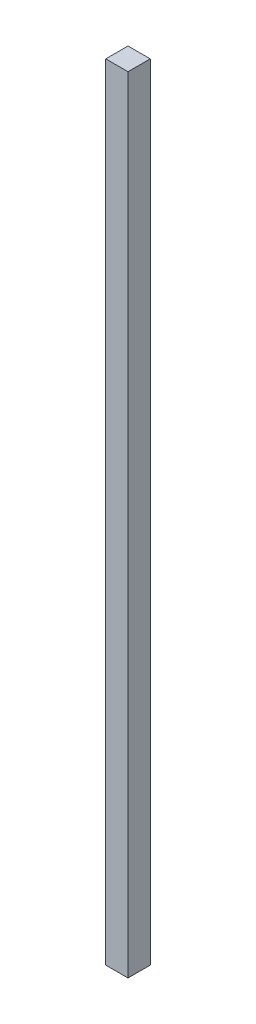
ISO-10303-21;
HEADER;
FILE_DESCRIPTION(('STEP AP214'),'2;1');
FILE_NAME('part.step','',(''),(''),'','','');
FILE_SCHEMA(('AUTOMOTIVE_DESIGN { 1 0 10303 214 1 1 1 1 }'));
ENDSEC;
DATA;
#1=APPLICATION_CONTEXT('core data for automotive mechanical design processes');
#2=APPLICATION_PROTOCOL_DEFINITION('international standard','automotive_design',2000,#1);
#3=PRODUCT_CONTEXT('',#1,'mechanical');
#4=PRODUCT('Part','Part','',(#3));
#5=PRODUCT_RELATED_PRODUCT_CATEGORY('part','',(#4));
#6=PRODUCT_DEFINITION_FORMATION('','',#4);
#7=PRODUCT_DEFINITION_CONTEXT('part definition',#1,'design');
#8=PRODUCT_DEFINITION('design','',#6,#7);
#9=PRODUCT_DEFINITION_SHAPE('','',#8);
#10=(LENGTH_UNIT() NAMED_UNIT(*) SI_UNIT(.MILLI.,.METRE.));
#11=(NAMED_UNIT(*) PLANE_ANGLE_UNIT() SI_UNIT($,.RADIAN.));
#12=(NAMED_UNIT(*) SI_UNIT($,.STERADIAN.) SOLID_ANGLE_UNIT());
#13=UNCERTAINTY_MEASURE_WITH_UNIT(LENGTH_MEASURE(1.E-05),#10,'distance_accuracy_value','');
#14=(GEOMETRIC_REPRESENTATION_CONTEXT(3) GLOBAL_UNCERTAINTY_ASSIGNED_CONTEXT((#13)) GLOBAL_UNIT_ASSIGNED_CONTEXT((#10,
#11,#12)) REPRESENTATION_CONTEXT('',''));
#15=CARTESIAN_POINT('',(0.,0.,0.));
#16=DIRECTION('',(0.,0.,1.));
#17=DIRECTION('',(1.,0.,0.));
#18=AXIS2_PLACEMENT_3D('',#15,#16,#17);
#19=CARTESIAN_POINT('',(2.5,176.37,-2.5));
#20=DIRECTION('',(-1.,0.,0.));
#21=DIRECTION('',(0.,0.,1.));
#22=AXIS2_PLACEMENT_3D('',#19,#20,#21);
#23=PLANE('',#22);
#24=DIRECTION('',(0.,0.,-1.));
#25=VECTOR('',#24,1.);
#26=CARTESIAN_POINT('',(2.5,0.,-2.5));
#27=LINE('',#26,#25);
#28=CARTESIAN_POINT('',(2.5,0.,2.5));
#29=VERTEX_POINT('',#28);
#30=CARTESIAN_POINT('',(2.5,0.,-2.5));
#31=VERTEX_POINT('',#30);
#32=EDGE_CURVE('E98',#29,#31,#27,.T.);
#33=ORIENTED_EDGE('',*,*,#32,.T.);
#34=DIRECTION('',(0.,-1.,0.));
#35=VECTOR('',#34,1.);
#36=CARTESIAN_POINT('',(2.5,176.37,-2.5));
#37=LINE('',#36,#35);
#38=CARTESIAN_POINT('',(2.5,176.37,-2.5));
#39=VERTEX_POINT('',#38);
#40=EDGE_CURVE('E11',#39,#31,#37,.T.);
#41=ORIENTED_EDGE('',*,*,#40,.F.);
#42=DIRECTION('',(0.,0.,-1.));
#43=VECTOR('',#42,1.);
#44=CARTESIAN_POINT('',(2.5,176.37,-2.5));
#45=LINE('',#44,#43);
#46=CARTESIAN_POINT('',(2.5,176.37,2.5));
#47=VERTEX_POINT('',#46);
#48=EDGE_CURVE('E86',#47,#39,#45,.T.);
#49=ORIENTED_EDGE('',*,*,#48,.F.);
#50=DIRECTION('',(0.,-1.,0.));
#51=VECTOR('',#50,1.);
#52=CARTESIAN_POINT('',(2.5,176.37,2.5));
#53=LINE('',#52,#51);
#54=EDGE_CURVE('E94',#47,#29,#53,.T.);
#55=ORIENTED_EDGE('',*,*,#54,.T.);
#56=EDGE_LOOP('',(#33,#41,#49,#55));
#57=FACE_BOUND('',#56,.T.);
#58=ADVANCED_FACE('F35',(#57),#23,.F.);
#59=CARTESIAN_POINT('',(-2.5,176.37,-2.5));
#60=DIRECTION('',(0.,0.,1.));
#61=DIRECTION('',(1.,0.,0.));
#62=AXIS2_PLACEMENT_3D('',#59,#60,#61);
#63=PLANE('',#62);
#64=DIRECTION('',(-1.,0.,0.));
#65=VECTOR('',#64,1.);
#66=CARTESIAN_POINT('',(-2.5,0.,-2.5));
#67=LINE('',#66,#65);
#68=CARTESIAN_POINT('',(-2.5,0.,-2.5));
#69=VERTEX_POINT('',#68);
#70=EDGE_CURVE('E90',#31,#69,#67,.T.);
#71=ORIENTED_EDGE('',*,*,#70,.T.);
#72=DIRECTION('',(0.,-1.,0.));
#73=VECTOR('',#72,1.);
#74=CARTESIAN_POINT('',(-2.5,176.37,-2.5));
#75=LINE('',#74,#73);
#76=CARTESIAN_POINT('',(-2.5,176.37,-2.5));
#77=VERTEX_POINT('',#76);
#78=EDGE_CURVE('E43',#77,#69,#75,.T.);
#79=ORIENTED_EDGE('',*,*,#78,.F.);
#80=DIRECTION('',(-1.,0.,0.));
#81=VECTOR('',#80,1.);
#82=CARTESIAN_POINT('',(-2.5,176.37,-2.5));
#83=LINE('',#82,#81);
#84=EDGE_CURVE('E81',#39,#77,#83,.T.);
#85=ORIENTED_EDGE('',*,*,#84,.F.);
#86=ORIENTED_EDGE('',*,*,#40,.T.);
#87=EDGE_LOOP('',(#71,#79,#85,#86));
#88=FACE_BOUND('',#87,.T.);
#89=ADVANCED_FACE('F89',(#88),#63,.F.);
#90=CARTESIAN_POINT('',(-2.5,176.37,-2.5));
#91=DIRECTION('',(1.,0.,0.));
#92=DIRECTION('',(0.,0.,-1.));
#93=AXIS2_PLACEMENT_3D('',#90,#91,#92);
#94=PLANE('',#93);
#95=DIRECTION('',(0.,0.,1.));
#96=VECTOR('',#95,1.);
#97=CARTESIAN_POINT('',(-2.5,0.,-2.5));
#98=LINE('',#97,#96);
#99=CARTESIAN_POINT('',(-2.5,0.,2.5));
#100=VERTEX_POINT('',#99);
#101=EDGE_CURVE('E68',#69,#100,#98,.T.);
#102=ORIENTED_EDGE('',*,*,#101,.T.);
#103=DIRECTION('',(0.,-1.,0.));
#104=VECTOR('',#103,1.);
#105=CARTESIAN_POINT('',(-2.5,176.37,2.5));
#106=LINE('',#105,#104);
#107=CARTESIAN_POINT('',(-2.5,176.37,2.5));
#108=VERTEX_POINT('',#107);
#109=EDGE_CURVE('E91',#108,#100,#106,.T.);
#110=ORIENTED_EDGE('',*,*,#109,.F.);
#111=DIRECTION('',(0.,0.,1.));
#112=VECTOR('',#111,1.);
#113=CARTESIAN_POINT('',(-2.5,176.37,-2.5));
#114=LINE('',#113,#112);
#115=EDGE_CURVE('E84',#77,#108,#114,.T.);
#116=ORIENTED_EDGE('',*,*,#115,.F.);
#117=ORIENTED_EDGE('',*,*,#78,.T.);
#118=EDGE_LOOP('',(#102,#110,#116,#117));
#119=FACE_BOUND('',#118,.T.);
#120=ADVANCED_FACE('F92',(#119),#94,.F.);
#121=CARTESIAN_POINT('',(-2.5,176.37,2.5));
#122=DIRECTION('',(0.,0.,-1.));
#123=DIRECTION('',(-1.,0.,0.));
#124=AXIS2_PLACEMENT_3D('',#121,#122,#123);
#125=PLANE('',#124);
#126=DIRECTION('',(1.,0.,0.));
#127=VECTOR('',#126,1.);
#128=CARTESIAN_POINT('',(-2.5,0.,2.5));
#129=LINE('',#128,#127);
#130=EDGE_CURVE('E74',#100,#29,#129,.T.);
#131=ORIENTED_EDGE('',*,*,#130,.T.);
#132=ORIENTED_EDGE('',*,*,#54,.F.);
#133=DIRECTION('',(1.,0.,0.));
#134=VECTOR('',#133,1.);
#135=CARTESIAN_POINT('',(-2.5,176.37,2.5));
#136=LINE('',#135,#134);
#137=EDGE_CURVE('E51',#108,#47,#136,.T.);
#138=ORIENTED_EDGE('',*,*,#137,.F.);
#139=ORIENTED_EDGE('',*,*,#109,.T.);
#140=EDGE_LOOP('',(#131,#132,#138,#139));
#141=FACE_BOUND('',#140,.T.);
#142=ADVANCED_FACE('F105',(#141),#125,.F.);
#143=CARTESIAN_POINT('',(0.,176.37,0.));
#144=DIRECTION('',(0.,1.,0.));
#145=DIRECTION('',(0.,0.,1.));
#146=AXIS2_PLACEMENT_3D('',#143,#144,#145);
#147=PLANE('',#146);
#148=ORIENTED_EDGE('',*,*,#48,.T.);
#149=ORIENTED_EDGE('',*,*,#84,.T.);
#150=ORIENTED_EDGE('',*,*,#115,.T.);
#151=ORIENTED_EDGE('',*,*,#137,.T.);
#152=EDGE_LOOP('',(#148,#149,#150,#151));
#153=FACE_BOUND('',#152,.T.);
#154=ADVANCED_FACE('F82',(#153),#147,.T.);
#155=CARTESIAN_POINT('',(0.,0.,0.));
#156=DIRECTION('',(0.,1.,0.));
#157=DIRECTION('',(0.,0.,1.));
#158=AXIS2_PLACEMENT_3D('',#155,#156,#157);
#159=PLANE('',#158);
#160=ORIENTED_EDGE('',*,*,#32,.F.);
#161=ORIENTED_EDGE('',*,*,#130,.F.);
#162=ORIENTED_EDGE('',*,*,#101,.F.);
#163=ORIENTED_EDGE('',*,*,#70,.F.);
#164=EDGE_LOOP('',(#160,#161,#162,#163));
#165=FACE_BOUND('',#164,.T.);
#166=ADVANCED_FACE('F108',(#165),#159,.F.);
#167=CLOSED_SHELL('',(#58,#89,#120,#142,#154,#166));
#168=MANIFOLD_SOLID_BREP('B2',#167);
#169=ADVANCED_BREP_SHAPE_REPRESENTATION('',(#18,#168),#14);
#170=SHAPE_DEFINITION_REPRESENTATION(#9,#169);
ENDSEC;
END-ISO-10303-21;
